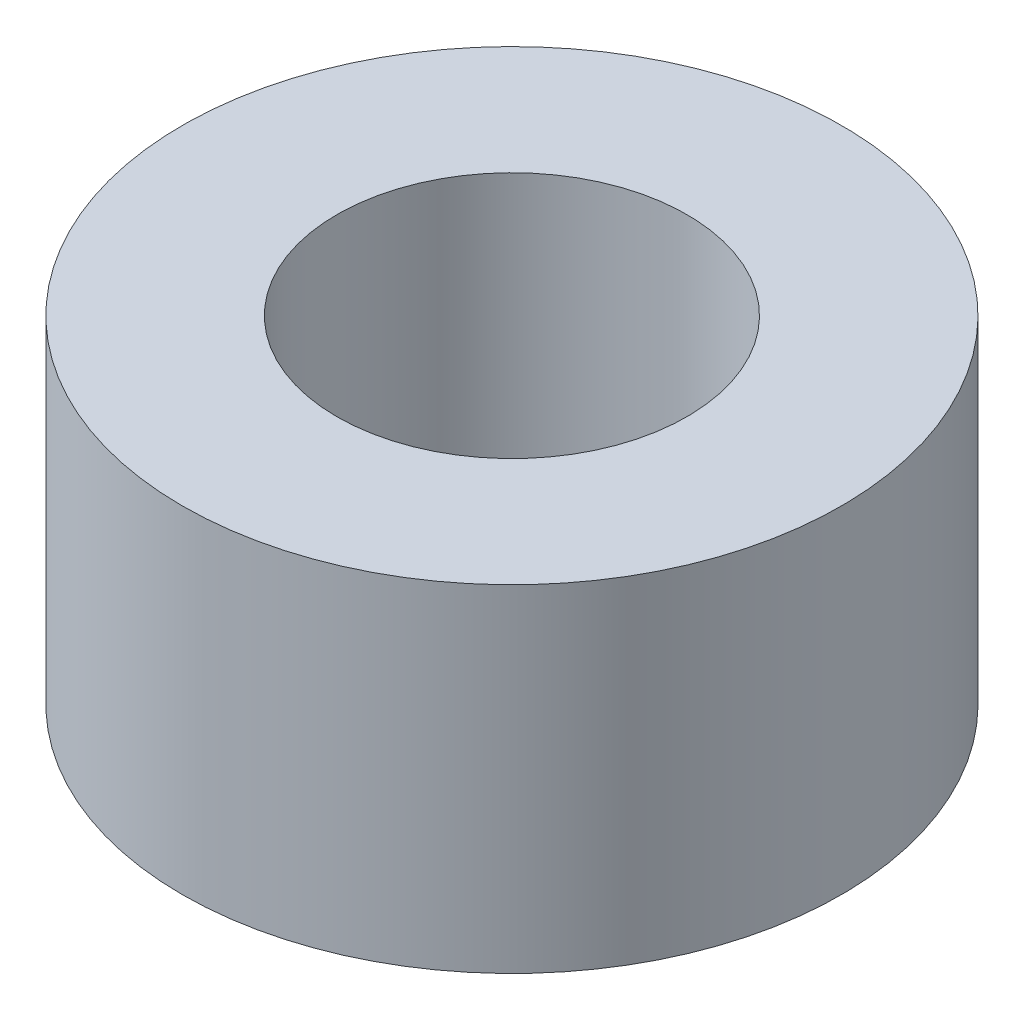
ISO-10303-21;
HEADER;
FILE_DESCRIPTION(('STEP AP214'),'2;1');
FILE_NAME('part.step','',(''),(''),'','','');
FILE_SCHEMA(('AUTOMOTIVE_DESIGN { 1 0 10303 214 1 1 1 1 }'));
ENDSEC;
DATA;
#1=APPLICATION_CONTEXT('core data for automotive mechanical design processes');
#2=APPLICATION_PROTOCOL_DEFINITION('international standard','automotive_design',2000,#1);
#3=PRODUCT_CONTEXT('',#1,'mechanical');
#4=PRODUCT('Part','Part','',(#3));
#5=PRODUCT_RELATED_PRODUCT_CATEGORY('part','',(#4));
#6=PRODUCT_DEFINITION_FORMATION('','',#4);
#7=PRODUCT_DEFINITION_CONTEXT('part definition',#1,'design');
#8=PRODUCT_DEFINITION('design','',#6,#7);
#9=PRODUCT_DEFINITION_SHAPE('','',#8);
#10=(LENGTH_UNIT() NAMED_UNIT(*) SI_UNIT(.MILLI.,.METRE.));
#11=(NAMED_UNIT(*) PLANE_ANGLE_UNIT() SI_UNIT($,.RADIAN.));
#12=(NAMED_UNIT(*) SI_UNIT($,.STERADIAN.) SOLID_ANGLE_UNIT());
#13=UNCERTAINTY_MEASURE_WITH_UNIT(LENGTH_MEASURE(1.E-05),#10,'distance_accuracy_value','');
#14=(GEOMETRIC_REPRESENTATION_CONTEXT(3) GLOBAL_UNCERTAINTY_ASSIGNED_CONTEXT((#13)) GLOBAL_UNIT_ASSIGNED_CONTEXT((#10,
#11,#12)) REPRESENTATION_CONTEXT('',''));
#15=CARTESIAN_POINT('',(0.,0.,0.));
#16=DIRECTION('',(0.,0.,1.));
#17=DIRECTION('',(1.,0.,0.));
#18=AXIS2_PLACEMENT_3D('',#15,#16,#17);
#19=CARTESIAN_POINT('',(0.,5.,0.));
#20=DIRECTION('',(0.,-1.,0.));
#21=DIRECTION('',(0.,0.,-1.));
#22=AXIS2_PLACEMENT_3D('',#19,#20,#21);
#23=CYLINDRICAL_SURFACE('',#22,4.89458492335947);
#24=CARTESIAN_POINT('',(0.,5.,0.));
#25=DIRECTION('',(0.,1.,0.));
#26=DIRECTION('',(0.,0.,1.));
#27=AXIS2_PLACEMENT_3D('',#24,#25,#26);
#28=CIRCLE('',#27,4.89458492335947);
#29=CARTESIAN_POINT('',(0.,5.,4.89458492335947));
#30=VERTEX_POINT('',#29);
#31=EDGE_CURVE('E10',#30,#30,#28,.T.);
#32=ORIENTED_EDGE('',*,*,#31,.F.);
#33=EDGE_LOOP('',(#32));
#34=FACE_BOUND('',#33,.T.);
#35=CARTESIAN_POINT('',(0.,0.,0.));
#36=DIRECTION('',(0.,1.,0.));
#37=DIRECTION('',(0.,0.,1.));
#38=AXIS2_PLACEMENT_3D('',#35,#36,#37);
#39=CIRCLE('',#38,4.89458492335947);
#40=CARTESIAN_POINT('',(0.,0.,4.89458492335947));
#41=VERTEX_POINT('',#40);
#42=EDGE_CURVE('E41',#41,#41,#39,.T.);
#43=ORIENTED_EDGE('',*,*,#42,.T.);
#44=EDGE_LOOP('',(#43));
#45=FACE_BOUND('',#44,.T.);
#46=ADVANCED_FACE('F38',(#34,#45),#23,.T.);
#47=CARTESIAN_POINT('',(0.,5.,0.));
#48=DIRECTION('',(0.,1.,0.));
#49=DIRECTION('',(0.,0.,1.));
#50=AXIS2_PLACEMENT_3D('',#47,#48,#49);
#51=PLANE('',#50);
#52=CARTESIAN_POINT('',(0.,5.,0.));
#53=DIRECTION('',(0.,1.,0.));
#54=DIRECTION('',(0.,0.,1.));
#55=AXIS2_PLACEMENT_3D('',#52,#53,#54);
#56=CIRCLE('',#55,2.6);
#57=CARTESIAN_POINT('',(0.,5.,2.6));
#58=VERTEX_POINT('',#57);
#59=EDGE_CURVE('E50',#58,#58,#56,.T.);
#60=ORIENTED_EDGE('',*,*,#59,.F.);
#61=EDGE_LOOP('',(#60));
#62=FACE_BOUND('',#61,.T.);
#63=ORIENTED_EDGE('',*,*,#31,.T.);
#64=EDGE_LOOP('',(#63));
#65=FACE_BOUND('',#64,.T.);
#66=ADVANCED_FACE('F65',(#62,#65),#51,.T.);
#67=CARTESIAN_POINT('',(0.,0.,0.));
#68=DIRECTION('',(0.,1.,0.));
#69=DIRECTION('',(0.,0.,1.));
#70=AXIS2_PLACEMENT_3D('',#67,#68,#69);
#71=PLANE('',#70);
#72=CARTESIAN_POINT('',(0.,0.,0.));
#73=DIRECTION('',(0.,1.,0.));
#74=DIRECTION('',(0.,0.,1.));
#75=AXIS2_PLACEMENT_3D('',#72,#73,#74);
#76=CIRCLE('',#75,2.6);
#77=CARTESIAN_POINT('',(0.,0.,2.6));
#78=VERTEX_POINT('',#77);
#79=EDGE_CURVE('E48',#78,#78,#76,.T.);
#80=ORIENTED_EDGE('',*,*,#79,.T.);
#81=EDGE_LOOP('',(#80));
#82=FACE_BOUND('',#81,.T.);
#83=ORIENTED_EDGE('',*,*,#42,.F.);
#84=EDGE_LOOP('',(#83));
#85=FACE_BOUND('',#84,.T.);
#86=ADVANCED_FACE('F56',(#82,#85),#71,.F.);
#87=CARTESIAN_POINT('',(0.,0.,0.));
#88=DIRECTION('',(0.,1.,0.));
#89=DIRECTION('',(0.,0.,1.));
#90=AXIS2_PLACEMENT_3D('',#87,#88,#89);
#91=CYLINDRICAL_SURFACE('',#90,2.6);
#92=ORIENTED_EDGE('',*,*,#79,.F.);
#93=EDGE_LOOP('',(#92));
#94=FACE_BOUND('',#93,.T.);
#95=ORIENTED_EDGE('',*,*,#59,.T.);
#96=EDGE_LOOP('',(#95));
#97=FACE_BOUND('',#96,.T.);
#98=ADVANCED_FACE('F59',(#94,#97),#91,.F.);
#99=CLOSED_SHELL('',(#46,#66,#86,#98));
#100=MANIFOLD_SOLID_BREP('B2',#99);
#101=ADVANCED_BREP_SHAPE_REPRESENTATION('',(#18,#100),#14);
#102=SHAPE_DEFINITION_REPRESENTATION(#9,#101);
ENDSEC;
END-ISO-10303-21;
